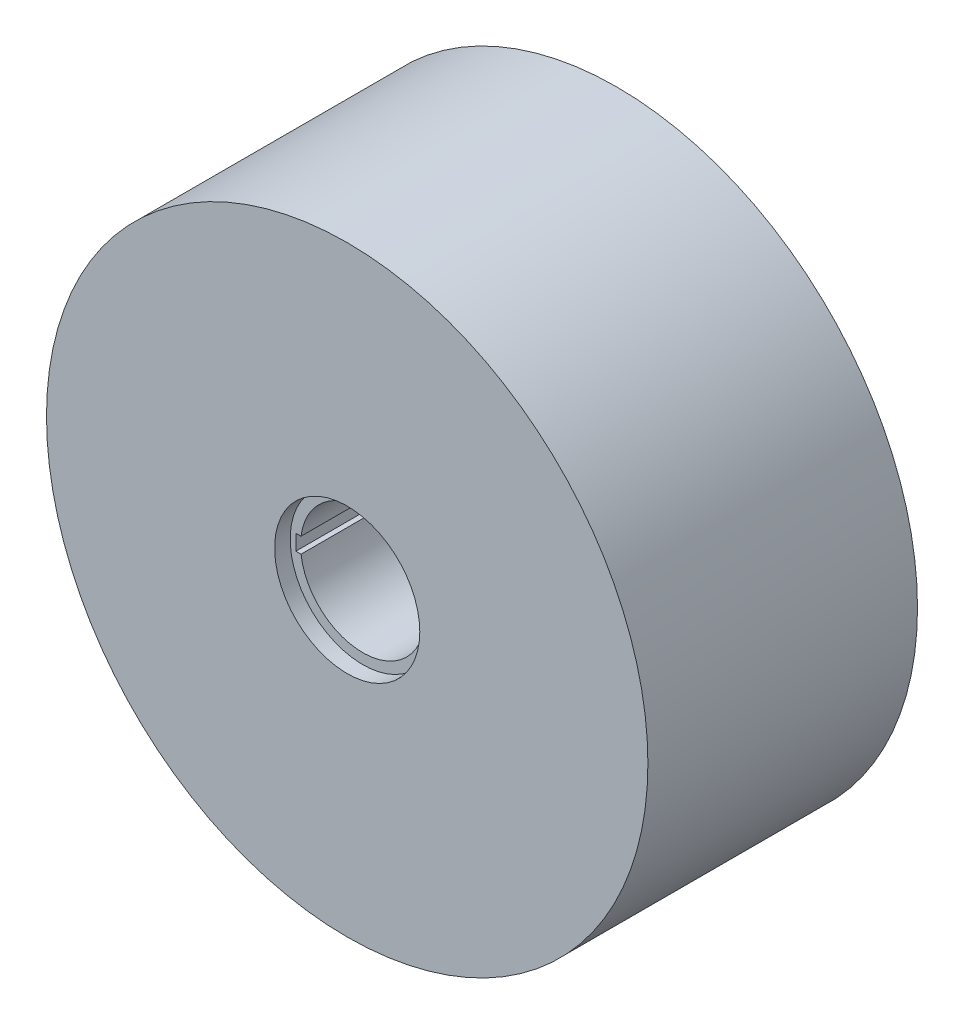
ISO-10303-21;
HEADER;
FILE_DESCRIPTION(('STEP AP214'),'2;1');
FILE_NAME('part.step','',(''),(''),'','','');
FILE_SCHEMA(('AUTOMOTIVE_DESIGN { 1 0 10303 214 1 1 1 1 }'));
ENDSEC;
DATA;
#1=APPLICATION_CONTEXT('core data for automotive mechanical design processes');
#2=APPLICATION_PROTOCOL_DEFINITION('international standard','automotive_design',2000,#1);
#3=PRODUCT_CONTEXT('',#1,'mechanical');
#4=PRODUCT('Part','Part','',(#3));
#5=PRODUCT_RELATED_PRODUCT_CATEGORY('part','',(#4));
#6=PRODUCT_DEFINITION_FORMATION('','',#4);
#7=PRODUCT_DEFINITION_CONTEXT('part definition',#1,'design');
#8=PRODUCT_DEFINITION('design','',#6,#7);
#9=PRODUCT_DEFINITION_SHAPE('','',#8);
#10=(LENGTH_UNIT() NAMED_UNIT(*) SI_UNIT(.MILLI.,.METRE.));
#11=(NAMED_UNIT(*) PLANE_ANGLE_UNIT() SI_UNIT($,.RADIAN.));
#12=(NAMED_UNIT(*) SI_UNIT($,.STERADIAN.) SOLID_ANGLE_UNIT());
#13=UNCERTAINTY_MEASURE_WITH_UNIT(LENGTH_MEASURE(1.E-05),#10,'distance_accuracy_value','');
#14=(GEOMETRIC_REPRESENTATION_CONTEXT(3) GLOBAL_UNCERTAINTY_ASSIGNED_CONTEXT((#13)) GLOBAL_UNIT_ASSIGNED_CONTEXT((#10,
#11,#12)) REPRESENTATION_CONTEXT('',''));
#15=CARTESIAN_POINT('',(0.,0.,0.));
#16=DIRECTION('',(0.,0.,1.));
#17=DIRECTION('',(1.,0.,0.));
#18=AXIS2_PLACEMENT_3D('',#15,#16,#17);
#19=CARTESIAN_POINT('',(0.,0.,-13.));
#20=DIRECTION('',(0.,0.,1.));
#21=DIRECTION('',(1.,0.,0.));
#22=AXIS2_PLACEMENT_3D('',#19,#20,#21);
#23=CYLINDRICAL_SURFACE('',#22,6.);
#24=CARTESIAN_POINT('',(0.,0.,-11.5));
#25=DIRECTION('',(0.,0.,-1.));
#26=DIRECTION('',(-1.,0.,0.));
#27=AXIS2_PLACEMENT_3D('',#24,#25,#26);
#28=CIRCLE('',#27,6.);
#29=CARTESIAN_POINT('',(-5.95294044989533,-0.75,-11.5));
#30=VERTEX_POINT('',#29);
#31=CARTESIAN_POINT('',(-5.95294044989533,0.75,-11.5));
#32=VERTEX_POINT('',#31);
#33=EDGE_CURVE('E51',#30,#32,#28,.F.);
#34=ORIENTED_EDGE('',*,*,#33,.F.);
#35=DIRECTION('',(0.,0.,1.));
#36=VECTOR('',#35,1.);
#37=CARTESIAN_POINT('',(-5.95294044989533,-0.75,-13.));
#38=LINE('',#37,#36);
#39=CARTESIAN_POINT('',(-5.95294044989533,-0.75,11.5));
#40=VERTEX_POINT('',#39);
#41=EDGE_CURVE('E92',#30,#40,#38,.T.);
#42=ORIENTED_EDGE('',*,*,#41,.T.);
#43=CARTESIAN_POINT('',(0.,0.,11.5));
#44=DIRECTION('',(0.,0.,1.));
#45=DIRECTION('',(1.,0.,0.));
#46=AXIS2_PLACEMENT_3D('',#43,#44,#45);
#47=CIRCLE('',#46,6.);
#48=CARTESIAN_POINT('',(-5.95294044989533,0.75,11.5));
#49=VERTEX_POINT('',#48);
#50=EDGE_CURVE('E105',#49,#40,#47,.F.);
#51=ORIENTED_EDGE('',*,*,#50,.F.);
#52=DIRECTION('',(0.,0.,1.));
#53=VECTOR('',#52,1.);
#54=CARTESIAN_POINT('',(-5.95294044989533,0.75,-13.));
#55=LINE('',#54,#53);
#56=EDGE_CURVE('E90',#32,#49,#55,.T.);
#57=ORIENTED_EDGE('',*,*,#56,.F.);
#58=EDGE_LOOP('',(#34,#42,#51,#57));
#59=FACE_BOUND('',#58,.T.);
#60=ADVANCED_FACE('F37',(#59),#23,.F.);
#61=CARTESIAN_POINT('',(-6.45294044989533,-0.75,-13.));
#62=DIRECTION('',(0.,-1.,0.));
#63=DIRECTION('',(0.,0.,-1.));
#64=AXIS2_PLACEMENT_3D('',#61,#62,#63);
#65=PLANE('',#64);
#66=DIRECTION('',(1.,0.,0.));
#67=VECTOR('',#66,1.);
#68=CARTESIAN_POINT('',(-6.45294044989533,-0.75,-11.5));
#69=LINE('',#68,#67);
#70=CARTESIAN_POINT('',(-6.45294044989533,-0.75,-11.5));
#71=VERTEX_POINT('',#70);
#72=EDGE_CURVE('E84',#71,#30,#69,.T.);
#73=ORIENTED_EDGE('',*,*,#72,.F.);
#74=DIRECTION('',(0.,0.,1.));
#75=VECTOR('',#74,1.);
#76=CARTESIAN_POINT('',(-6.45294044989533,-0.75,-13.));
#77=LINE('',#76,#75);
#78=CARTESIAN_POINT('',(-6.45294044989533,-0.75,11.5));
#79=VERTEX_POINT('',#78);
#80=EDGE_CURVE('E83',#71,#79,#77,.T.);
#81=ORIENTED_EDGE('',*,*,#80,.T.);
#82=DIRECTION('',(-1.,0.,0.));
#83=VECTOR('',#82,1.);
#84=CARTESIAN_POINT('',(-6.45294044989533,-0.75,11.5));
#85=LINE('',#84,#83);
#86=EDGE_CURVE('E110',#40,#79,#85,.T.);
#87=ORIENTED_EDGE('',*,*,#86,.F.);
#88=ORIENTED_EDGE('',*,*,#41,.F.);
#89=EDGE_LOOP('',(#73,#81,#87,#88));
#90=FACE_BOUND('',#89,.T.);
#91=ADVANCED_FACE('F145',(#90),#65,.F.);
#92=CARTESIAN_POINT('',(-6.45294044989533,0.75,-13.));
#93=DIRECTION('',(-1.,0.,0.));
#94=DIRECTION('',(0.,0.,1.));
#95=AXIS2_PLACEMENT_3D('',#92,#93,#94);
#96=PLANE('',#95);
#97=DIRECTION('',(0.,-1.,0.));
#98=VECTOR('',#97,1.);
#99=CARTESIAN_POINT('',(-6.45294044989533,0.75,-11.5));
#100=LINE('',#99,#98);
#101=CARTESIAN_POINT('',(-6.45294044989533,0.75,-11.5));
#102=VERTEX_POINT('',#101);
#103=EDGE_CURVE('E77',#102,#71,#100,.T.);
#104=ORIENTED_EDGE('',*,*,#103,.F.);
#105=DIRECTION('',(0.,0.,1.));
#106=VECTOR('',#105,1.);
#107=CARTESIAN_POINT('',(-6.45294044989533,0.75,-13.));
#108=LINE('',#107,#106);
#109=CARTESIAN_POINT('',(-6.45294044989533,0.75,11.5));
#110=VERTEX_POINT('',#109);
#111=EDGE_CURVE('E59',#102,#110,#108,.T.);
#112=ORIENTED_EDGE('',*,*,#111,.T.);
#113=DIRECTION('',(0.,1.,0.));
#114=VECTOR('',#113,1.);
#115=CARTESIAN_POINT('',(-6.45294044989533,0.75,11.5));
#116=LINE('',#115,#114);
#117=EDGE_CURVE('E107',#79,#110,#116,.T.);
#118=ORIENTED_EDGE('',*,*,#117,.F.);
#119=ORIENTED_EDGE('',*,*,#80,.F.);
#120=EDGE_LOOP('',(#104,#112,#118,#119));
#121=FACE_BOUND('',#120,.T.);
#122=ADVANCED_FACE('F82',(#121),#96,.F.);
#123=CARTESIAN_POINT('',(-5.95294044989533,0.75,-13.));
#124=DIRECTION('',(0.,1.,0.));
#125=DIRECTION('',(0.,0.,1.));
#126=AXIS2_PLACEMENT_3D('',#123,#124,#125);
#127=PLANE('',#126);
#128=DIRECTION('',(-1.,0.,0.));
#129=VECTOR('',#128,1.);
#130=CARTESIAN_POINT('',(-5.95294044989533,0.75,-11.5));
#131=LINE('',#130,#129);
#132=EDGE_CURVE('E11',#32,#102,#131,.T.);
#133=ORIENTED_EDGE('',*,*,#132,.F.);
#134=ORIENTED_EDGE('',*,*,#56,.T.);
#135=DIRECTION('',(1.,0.,0.));
#136=VECTOR('',#135,1.);
#137=CARTESIAN_POINT('',(-5.95294044989533,0.75,11.5));
#138=LINE('',#137,#136);
#139=EDGE_CURVE('E45',#110,#49,#138,.T.);
#140=ORIENTED_EDGE('',*,*,#139,.F.);
#141=ORIENTED_EDGE('',*,*,#111,.F.);
#142=EDGE_LOOP('',(#133,#134,#140,#141));
#143=FACE_BOUND('',#142,.T.);
#144=ADVANCED_FACE('F88',(#143),#127,.F.);
#145=CARTESIAN_POINT('',(0.,0.,-13.));
#146=DIRECTION('',(0.,0.,1.));
#147=DIRECTION('',(1.,0.,0.));
#148=AXIS2_PLACEMENT_3D('',#145,#146,#147);
#149=CYLINDRICAL_SURFACE('',#148,29.);
#150=CARTESIAN_POINT('',(0.,0.,-13.));
#151=DIRECTION('',(0.,0.,1.));
#152=DIRECTION('',(1.,0.,0.));
#153=AXIS2_PLACEMENT_3D('',#150,#151,#152);
#154=CIRCLE('',#153,29.);
#155=CARTESIAN_POINT('',(29.,0.,-13.));
#156=VERTEX_POINT('',#155);
#157=EDGE_CURVE('E98',#156,#156,#154,.T.);
#158=ORIENTED_EDGE('',*,*,#157,.T.);
#159=EDGE_LOOP('',(#158));
#160=FACE_BOUND('',#159,.T.);
#161=CARTESIAN_POINT('',(0.,0.,13.));
#162=DIRECTION('',(0.,0.,1.));
#163=DIRECTION('',(1.,0.,0.));
#164=AXIS2_PLACEMENT_3D('',#161,#162,#163);
#165=CIRCLE('',#164,29.);
#166=CARTESIAN_POINT('',(29.,0.,13.));
#167=VERTEX_POINT('',#166);
#168=EDGE_CURVE('E94',#167,#167,#165,.T.);
#169=ORIENTED_EDGE('',*,*,#168,.F.);
#170=EDGE_LOOP('',(#169));
#171=FACE_BOUND('',#170,.T.);
#172=ADVANCED_FACE('F39',(#160,#171),#149,.T.);
#173=CARTESIAN_POINT('',(0.,0.,-13.));
#174=DIRECTION('',(0.,0.,1.));
#175=DIRECTION('',(1.,0.,0.));
#176=AXIS2_PLACEMENT_3D('',#173,#174,#175);
#177=PLANE('',#176);
#178=CARTESIAN_POINT('',(0.,0.,-13.));
#179=DIRECTION('',(0.,0.,1.));
#180=DIRECTION('',(1.,0.,0.));
#181=AXIS2_PLACEMENT_3D('',#178,#179,#180);
#182=CIRCLE('',#181,7.);
#183=CARTESIAN_POINT('',(7.,0.,-13.));
#184=VERTEX_POINT('',#183);
#185=EDGE_CURVE('E125',#184,#184,#182,.T.);
#186=ORIENTED_EDGE('',*,*,#185,.T.);
#187=EDGE_LOOP('',(#186));
#188=FACE_BOUND('',#187,.T.);
#189=ORIENTED_EDGE('',*,*,#157,.F.);
#190=EDGE_LOOP('',(#189));
#191=FACE_BOUND('',#190,.T.);
#192=ADVANCED_FACE('F154',(#188,#191),#177,.F.);
#193=CARTESIAN_POINT('',(0.,0.,13.));
#194=DIRECTION('',(0.,0.,1.));
#195=DIRECTION('',(1.,0.,0.));
#196=AXIS2_PLACEMENT_3D('',#193,#194,#195);
#197=PLANE('',#196);
#198=CARTESIAN_POINT('',(0.,0.,13.));
#199=DIRECTION('',(0.,0.,1.));
#200=DIRECTION('',(1.,0.,0.));
#201=AXIS2_PLACEMENT_3D('',#198,#199,#200);
#202=CIRCLE('',#201,7.);
#203=CARTESIAN_POINT('',(7.,0.,13.));
#204=VERTEX_POINT('',#203);
#205=EDGE_CURVE('E118',#204,#204,#202,.T.);
#206=ORIENTED_EDGE('',*,*,#205,.F.);
#207=EDGE_LOOP('',(#206));
#208=FACE_BOUND('',#207,.T.);
#209=ORIENTED_EDGE('',*,*,#168,.T.);
#210=EDGE_LOOP('',(#209));
#211=FACE_BOUND('',#210,.T.);
#212=ADVANCED_FACE('F156',(#208,#211),#197,.T.);
#213=CARTESIAN_POINT('',(0.,0.,11.5));
#214=DIRECTION('',(0.,0.,1.));
#215=DIRECTION('',(1.,0.,0.));
#216=AXIS2_PLACEMENT_3D('',#213,#214,#215);
#217=PLANE('',#216);
#218=CARTESIAN_POINT('',(0.,0.,11.5));
#219=DIRECTION('',(0.,0.,1.));
#220=DIRECTION('',(1.,0.,0.));
#221=AXIS2_PLACEMENT_3D('',#218,#219,#220);
#222=CIRCLE('',#221,7.);
#223=CARTESIAN_POINT('',(7.,0.,11.5));
#224=VERTEX_POINT('',#223);
#225=EDGE_CURVE('E117',#224,#224,#222,.T.);
#226=ORIENTED_EDGE('',*,*,#225,.T.);
#227=EDGE_LOOP('',(#226));
#228=FACE_BOUND('',#227,.T.);
#229=ORIENTED_EDGE('',*,*,#50,.T.);
#230=ORIENTED_EDGE('',*,*,#86,.T.);
#231=ORIENTED_EDGE('',*,*,#117,.T.);
#232=ORIENTED_EDGE('',*,*,#139,.T.);
#233=EDGE_LOOP('',(#229,#230,#231,#232));
#234=FACE_BOUND('',#233,.T.);
#235=ADVANCED_FACE('F103',(#228,#234),#217,.T.);
#236=CARTESIAN_POINT('',(0.,0.,11.5));
#237=DIRECTION('',(0.,0.,1.));
#238=DIRECTION('',(1.,0.,0.));
#239=AXIS2_PLACEMENT_3D('',#236,#237,#238);
#240=CYLINDRICAL_SURFACE('',#239,7.);
#241=ORIENTED_EDGE('',*,*,#225,.F.);
#242=EDGE_LOOP('',(#241));
#243=FACE_BOUND('',#242,.T.);
#244=ORIENTED_EDGE('',*,*,#205,.T.);
#245=EDGE_LOOP('',(#244));
#246=FACE_BOUND('',#245,.T.);
#247=ADVANCED_FACE('F135',(#243,#246),#240,.F.);
#248=CARTESIAN_POINT('',(0.,0.,-11.5));
#249=DIRECTION('',(0.,0.,-1.));
#250=DIRECTION('',(1.,0.,0.));
#251=AXIS2_PLACEMENT_3D('',#248,#249,#250);
#252=PLANE('',#251);
#253=CARTESIAN_POINT('',(0.,0.,-11.5));
#254=DIRECTION('',(0.,0.,1.));
#255=DIRECTION('',(1.,0.,0.));
#256=AXIS2_PLACEMENT_3D('',#253,#254,#255);
#257=CIRCLE('',#256,7.);
#258=CARTESIAN_POINT('',(7.,0.,-11.5));
#259=VERTEX_POINT('',#258);
#260=EDGE_CURVE('E85',#259,#259,#257,.T.);
#261=ORIENTED_EDGE('',*,*,#260,.F.);
#262=EDGE_LOOP('',(#261));
#263=FACE_BOUND('',#262,.T.);
#264=ORIENTED_EDGE('',*,*,#33,.T.);
#265=ORIENTED_EDGE('',*,*,#132,.T.);
#266=ORIENTED_EDGE('',*,*,#103,.T.);
#267=ORIENTED_EDGE('',*,*,#72,.T.);
#268=EDGE_LOOP('',(#264,#265,#266,#267));
#269=FACE_BOUND('',#268,.T.);
#270=ADVANCED_FACE('F76',(#263,#269),#252,.T.);
#271=CARTESIAN_POINT('',(0.,0.,-11.5));
#272=DIRECTION('',(0.,0.,-1.));
#273=DIRECTION('',(-1.,0.,0.));
#274=AXIS2_PLACEMENT_3D('',#271,#272,#273);
#275=CYLINDRICAL_SURFACE('',#274,7.);
#276=ORIENTED_EDGE('',*,*,#260,.T.);
#277=EDGE_LOOP('',(#276));
#278=FACE_BOUND('',#277,.T.);
#279=ORIENTED_EDGE('',*,*,#185,.F.);
#280=EDGE_LOOP('',(#279));
#281=FACE_BOUND('',#280,.T.);
#282=ADVANCED_FACE('F131',(#278,#281),#275,.F.);
#283=CLOSED_SHELL('',(#60,#91,#122,#144,#172,#192,#212,#235,#247,#270,#282));
#284=MANIFOLD_SOLID_BREP('B2',#283);
#285=ADVANCED_BREP_SHAPE_REPRESENTATION('',(#18,#284),#14);
#286=SHAPE_DEFINITION_REPRESENTATION(#9,#285);
ENDSEC;
END-ISO-10303-21;
